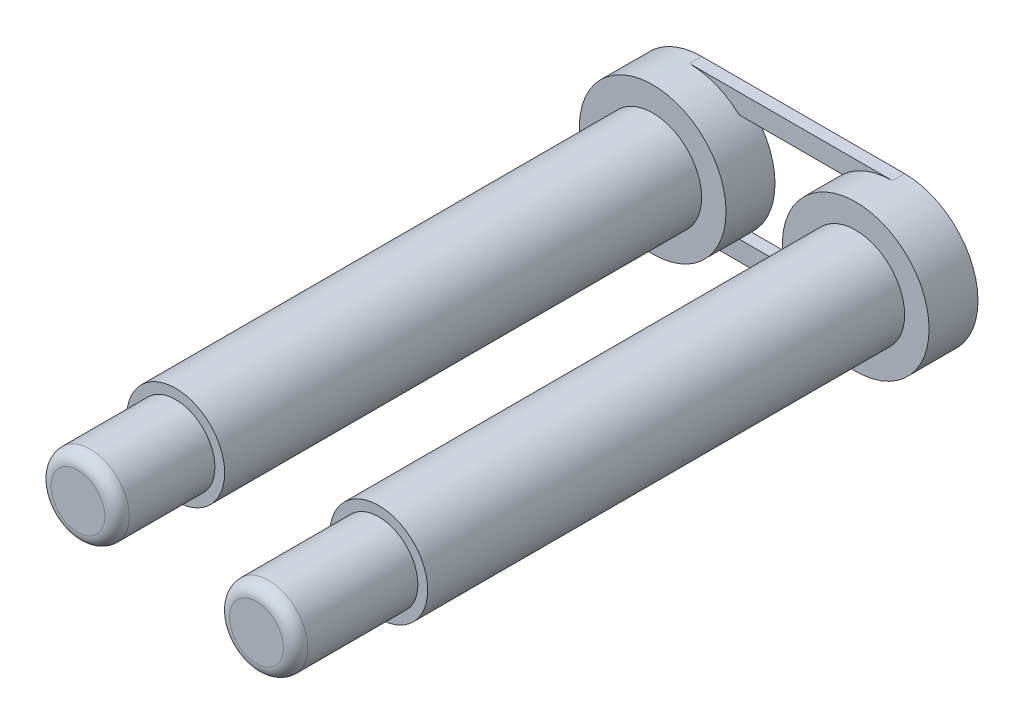
ISO-10303-21;
HEADER;
FILE_DESCRIPTION(('STEP AP214'),'2;1');
FILE_NAME('part.step','',(''),(''),'','','');
FILE_SCHEMA(('AUTOMOTIVE_DESIGN { 1 0 10303 214 1 1 1 1 }'));
ENDSEC;
DATA;
#1=APPLICATION_CONTEXT('core data for automotive mechanical design processes');
#2=APPLICATION_PROTOCOL_DEFINITION('international standard','automotive_design',2000,#1);
#3=PRODUCT_CONTEXT('',#1,'mechanical');
#4=PRODUCT('Part','Part','',(#3));
#5=PRODUCT_RELATED_PRODUCT_CATEGORY('part','',(#4));
#6=PRODUCT_DEFINITION_FORMATION('','',#4);
#7=PRODUCT_DEFINITION_CONTEXT('part definition',#1,'design');
#8=PRODUCT_DEFINITION('design','',#6,#7);
#9=PRODUCT_DEFINITION_SHAPE('','',#8);
#10=(LENGTH_UNIT() NAMED_UNIT(*) SI_UNIT(.MILLI.,.METRE.));
#11=(NAMED_UNIT(*) PLANE_ANGLE_UNIT() SI_UNIT($,.RADIAN.));
#12=(NAMED_UNIT(*) SI_UNIT($,.STERADIAN.) SOLID_ANGLE_UNIT());
#13=UNCERTAINTY_MEASURE_WITH_UNIT(LENGTH_MEASURE(1.E-05),#10,'distance_accuracy_value','');
#14=(GEOMETRIC_REPRESENTATION_CONTEXT(3) GLOBAL_UNCERTAINTY_ASSIGNED_CONTEXT((#13)) GLOBAL_UNIT_ASSIGNED_CONTEXT((#10,
#11,#12)) REPRESENTATION_CONTEXT('',''));
#15=CARTESIAN_POINT('',(0.,0.,0.));
#16=DIRECTION('',(0.,0.,1.));
#17=DIRECTION('',(1.,0.,0.));
#18=AXIS2_PLACEMENT_3D('',#15,#16,#17);
#19=CARTESIAN_POINT('',(23.5,37.3,2.));
#20=DIRECTION('',(0.,0.,-1.));
#21=DIRECTION('',(-1.,0.,0.));
#22=AXIS2_PLACEMENT_3D('',#19,#20,#21);
#23=CYLINDRICAL_SURFACE('',#22,3.);
#24=CARTESIAN_POINT('',(23.5,37.3,2.));
#25=DIRECTION('',(0.,0.,1.));
#26=DIRECTION('',(1.,0.,0.));
#27=AXIS2_PLACEMENT_3D('',#24,#25,#26);
#28=CIRCLE('',#27,3.);
#29=CARTESIAN_POINT('',(26.5,37.3,2.));
#30=VERTEX_POINT('',#29);
#31=EDGE_CURVE('E172',#30,#30,#28,.T.);
#32=ORIENTED_EDGE('',*,*,#31,.F.);
#33=EDGE_LOOP('',(#32));
#34=FACE_BOUND('',#33,.T.);
#35=DIRECTION('',(0.,0.,-1.));
#36=VECTOR('',#35,1.);
#37=CARTESIAN_POINT('',(21.4603921945629,39.5,0.5));
#38=LINE('',#37,#36);
#39=CARTESIAN_POINT('',(21.4603921945629,39.5,0.5));
#40=VERTEX_POINT('',#39);
#41=CARTESIAN_POINT('',(21.4603921945629,39.5,0.));
#42=VERTEX_POINT('',#41);
#43=EDGE_CURVE('E137',#40,#42,#38,.T.);
#44=ORIENTED_EDGE('',*,*,#43,.T.);
#45=CARTESIAN_POINT('',(23.5,37.3,0.));
#46=DIRECTION('',(0.,0.,1.));
#47=DIRECTION('',(1.,0.,0.));
#48=AXIS2_PLACEMENT_3D('',#45,#46,#47);
#49=CIRCLE('',#48,3.);
#50=CARTESIAN_POINT('',(21.4603921945629,35.1,0.));
#51=VERTEX_POINT('',#50);
#52=EDGE_CURVE('E168',#42,#51,#49,.T.);
#53=ORIENTED_EDGE('',*,*,#52,.T.);
#54=DIRECTION('',(0.,0.,-1.));
#55=VECTOR('',#54,1.);
#56=CARTESIAN_POINT('',(21.4603921945629,35.1,0.5));
#57=LINE('',#56,#55);
#58=CARTESIAN_POINT('',(21.4603921945629,35.1,0.5));
#59=VERTEX_POINT('',#58);
#60=EDGE_CURVE('E160',#59,#51,#57,.T.);
#61=ORIENTED_EDGE('',*,*,#60,.F.);
#62=CARTESIAN_POINT('',(23.5,37.3,0.5));
#63=DIRECTION('',(0.,0.,1.));
#64=DIRECTION('',(1.,0.,0.));
#65=AXIS2_PLACEMENT_3D('',#62,#63,#64);
#66=CIRCLE('',#65,3.);
#67=CARTESIAN_POINT('',(23.5,34.3,0.5));
#68=VERTEX_POINT('',#67);
#69=EDGE_CURVE('E148',#59,#68,#66,.T.);
#70=ORIENTED_EDGE('',*,*,#69,.T.);
#71=DIRECTION('',(0.,0.,-1.));
#72=VECTOR('',#71,1.);
#73=CARTESIAN_POINT('',(23.5,34.3,0.5));
#74=LINE('',#73,#72);
#75=CARTESIAN_POINT('',(23.5,34.3,0.));
#76=VERTEX_POINT('',#75);
#77=EDGE_CURVE('E163',#68,#76,#74,.T.);
#78=ORIENTED_EDGE('',*,*,#77,.T.);
#79=CARTESIAN_POINT('',(23.5,40.3,0.));
#80=VERTEX_POINT('',#79);
#81=EDGE_CURVE('E173',#76,#80,#49,.T.);
#82=ORIENTED_EDGE('',*,*,#81,.T.);
#83=DIRECTION('',(0.,0.,-1.));
#84=VECTOR('',#83,1.);
#85=CARTESIAN_POINT('',(23.5,40.3,0.5));
#86=LINE('',#85,#84);
#87=CARTESIAN_POINT('',(23.5,40.3,0.5));
#88=VERTEX_POINT('',#87);
#89=EDGE_CURVE('E59',#88,#80,#86,.T.);
#90=ORIENTED_EDGE('',*,*,#89,.F.);
#91=CARTESIAN_POINT('',(23.5,37.3,0.5));
#92=DIRECTION('',(0.,0.,1.));
#93=DIRECTION('',(1.,0.,0.));
#94=AXIS2_PLACEMENT_3D('',#91,#92,#93);
#95=CIRCLE('',#94,3.);
#96=EDGE_CURVE('E54',#88,#40,#95,.T.);
#97=ORIENTED_EDGE('',*,*,#96,.T.);
#98=EDGE_LOOP('',(#44,#53,#61,#70,#78,#82,#90,#97));
#99=FACE_BOUND('',#98,.T.);
#100=ADVANCED_FACE('F39',(#34,#99),#23,.T.);
#101=CARTESIAN_POINT('',(23.5,37.3,21.5));
#102=DIRECTION('',(0.,0.,-1.));
#103=DIRECTION('',(-1.,0.,0.));
#104=AXIS2_PLACEMENT_3D('',#101,#102,#103);
#105=CYLINDRICAL_SURFACE('',#104,2.);
#106=CARTESIAN_POINT('',(23.5,37.3,2.));
#107=DIRECTION('',(0.,0.,1.));
#108=DIRECTION('',(1.,0.,0.));
#109=AXIS2_PLACEMENT_3D('',#106,#107,#108);
#110=CIRCLE('',#109,2.);
#111=CARTESIAN_POINT('',(25.5,37.3,2.));
#112=VERTEX_POINT('',#111);
#113=EDGE_CURVE('E169',#112,#112,#110,.T.);
#114=ORIENTED_EDGE('',*,*,#113,.T.);
#115=EDGE_LOOP('',(#114));
#116=FACE_BOUND('',#115,.T.);
#117=CARTESIAN_POINT('',(23.5,37.3,21.5));
#118=DIRECTION('',(0.,0.,1.));
#119=DIRECTION('',(1.,0.,0.));
#120=AXIS2_PLACEMENT_3D('',#117,#118,#119);
#121=CIRCLE('',#120,2.);
#122=CARTESIAN_POINT('',(25.5,37.3,21.5));
#123=VERTEX_POINT('',#122);
#124=EDGE_CURVE('E180',#123,#123,#121,.T.);
#125=ORIENTED_EDGE('',*,*,#124,.F.);
#126=EDGE_LOOP('',(#125));
#127=FACE_BOUND('',#126,.T.);
#128=ADVANCED_FACE('F203',(#116,#127),#105,.T.);
#129=CARTESIAN_POINT('',(0.,0.,21.5));
#130=DIRECTION('',(0.,0.,1.));
#131=DIRECTION('',(1.,0.,0.));
#132=AXIS2_PLACEMENT_3D('',#129,#130,#131);
#133=PLANE('',#132);
#134=CARTESIAN_POINT('',(23.5,37.3,21.5));
#135=DIRECTION('',(0.,0.,1.));
#136=DIRECTION('',(1.,0.,0.));
#137=AXIS2_PLACEMENT_3D('',#134,#135,#136);
#138=CIRCLE('',#137,1.6);
#139=CARTESIAN_POINT('',(25.1,37.3,21.5));
#140=VERTEX_POINT('',#139);
#141=EDGE_CURVE('E176',#140,#140,#138,.T.);
#142=ORIENTED_EDGE('',*,*,#141,.F.);
#143=EDGE_LOOP('',(#142));
#144=FACE_BOUND('',#143,.T.);
#145=ORIENTED_EDGE('',*,*,#124,.T.);
#146=EDGE_LOOP('',(#145));
#147=FACE_BOUND('',#146,.T.);
#148=ADVANCED_FACE('F209',(#144,#147),#133,.T.);
#149=CARTESIAN_POINT('',(23.5,37.3,26.5));
#150=DIRECTION('',(0.,0.,-1.));
#151=DIRECTION('',(-1.,0.,0.));
#152=AXIS2_PLACEMENT_3D('',#149,#150,#151);
#153=CYLINDRICAL_SURFACE('',#152,1.6);
#154=CARTESIAN_POINT('',(23.5,37.3,26.));
#155=DIRECTION('',(0.,0.,1.));
#156=DIRECTION('',(1.,0.,0.));
#157=AXIS2_PLACEMENT_3D('',#154,#155,#156);
#158=CIRCLE('',#157,1.6);
#159=CARTESIAN_POINT('',(25.1,37.3,26.));
#160=VERTEX_POINT('',#159);
#161=EDGE_CURVE('E186',#160,#160,#158,.F.);
#162=ORIENTED_EDGE('',*,*,#161,.T.);
#163=EDGE_LOOP('',(#162));
#164=FACE_BOUND('',#163,.T.);
#165=ORIENTED_EDGE('',*,*,#141,.T.);
#166=EDGE_LOOP('',(#165));
#167=FACE_BOUND('',#166,.T.);
#168=ADVANCED_FACE('F220',(#164,#167),#153,.T.);
#169=CARTESIAN_POINT('',(0.,0.,26.5));
#170=DIRECTION('',(0.,0.,1.));
#171=DIRECTION('',(1.,0.,0.));
#172=AXIS2_PLACEMENT_3D('',#169,#170,#171);
#173=PLANE('',#172);
#174=CARTESIAN_POINT('',(23.5,37.3,26.5));
#175=DIRECTION('',(0.,0.,1.));
#176=DIRECTION('',(1.,0.,0.));
#177=AXIS2_PLACEMENT_3D('',#174,#175,#176);
#178=CIRCLE('',#177,1.1);
#179=CARTESIAN_POINT('',(24.6,37.3,26.5));
#180=VERTEX_POINT('',#179);
#181=EDGE_CURVE('E183',#180,#180,#178,.T.);
#182=ORIENTED_EDGE('',*,*,#181,.T.);
#183=EDGE_LOOP('',(#182));
#184=FACE_BOUND('',#183,.T.);
#185=ADVANCED_FACE('F217',(#184),#173,.T.);
#186=CARTESIAN_POINT('',(0.,0.,2.));
#187=DIRECTION('',(0.,0.,1.));
#188=DIRECTION('',(1.,0.,0.));
#189=AXIS2_PLACEMENT_3D('',#186,#187,#188);
#190=PLANE('',#189);
#191=ORIENTED_EDGE('',*,*,#113,.F.);
#192=EDGE_LOOP('',(#191));
#193=FACE_BOUND('',#192,.T.);
#194=ORIENTED_EDGE('',*,*,#31,.T.);
#195=EDGE_LOOP('',(#194));
#196=FACE_BOUND('',#195,.T.);
#197=ADVANCED_FACE('F215',(#193,#196),#190,.T.);
#198=CARTESIAN_POINT('',(0.,0.,0.));
#199=DIRECTION('',(0.,0.,1.));
#200=DIRECTION('',(1.,0.,0.));
#201=AXIS2_PLACEMENT_3D('',#198,#199,#200);
#202=PLANE('',#201);
#203=CARTESIAN_POINT('',(15.2,37.3,0.));
#204=DIRECTION('',(0.,0.,1.));
#205=DIRECTION('',(1.,0.,0.));
#206=AXIS2_PLACEMENT_3D('',#203,#204,#205);
#207=CIRCLE('',#206,3.);
#208=CARTESIAN_POINT('',(17.2396078054371,35.1,0.));
#209=VERTEX_POINT('',#208);
#210=CARTESIAN_POINT('',(17.2396078054371,39.5,0.));
#211=VERTEX_POINT('',#210);
#212=EDGE_CURVE('E129',#209,#211,#207,.T.);
#213=ORIENTED_EDGE('',*,*,#212,.F.);
#214=DIRECTION('',(1.,0.,0.));
#215=VECTOR('',#214,1.);
#216=CARTESIAN_POINT('',(0.,35.1,0.));
#217=LINE('',#216,#215);
#218=EDGE_CURVE('E145',#209,#51,#217,.T.);
#219=ORIENTED_EDGE('',*,*,#218,.T.);
#220=ORIENTED_EDGE('',*,*,#52,.F.);
#221=DIRECTION('',(1.,0.,0.));
#222=VECTOR('',#221,1.);
#223=CARTESIAN_POINT('',(0.,39.5,0.));
#224=LINE('',#223,#222);
#225=EDGE_CURVE('E126',#211,#42,#224,.T.);
#226=ORIENTED_EDGE('',*,*,#225,.F.);
#227=EDGE_LOOP('',(#213,#219,#220,#226));
#228=FACE_BOUND('',#227,.T.);
#229=ORIENTED_EDGE('',*,*,#81,.F.);
#230=DIRECTION('',(1.,0.,0.));
#231=VECTOR('',#230,1.);
#232=CARTESIAN_POINT('',(0.,34.3,0.));
#233=LINE('',#232,#231);
#234=CARTESIAN_POINT('',(15.2,34.3,0.));
#235=VERTEX_POINT('',#234);
#236=EDGE_CURVE('E140',#235,#76,#233,.T.);
#237=ORIENTED_EDGE('',*,*,#236,.F.);
#238=CARTESIAN_POINT('',(15.2,40.3,0.));
#239=VERTEX_POINT('',#238);
#240=EDGE_CURVE('E276',#239,#235,#207,.T.);
#241=ORIENTED_EDGE('',*,*,#240,.F.);
#242=DIRECTION('',(1.,0.,0.));
#243=VECTOR('',#242,1.);
#244=CARTESIAN_POINT('',(0.,40.3,0.));
#245=LINE('',#244,#243);
#246=EDGE_CURVE('E115',#239,#80,#245,.T.);
#247=ORIENTED_EDGE('',*,*,#246,.T.);
#248=EDGE_LOOP('',(#229,#237,#241,#247));
#249=FACE_BOUND('',#248,.T.);
#250=ADVANCED_FACE('F228',(#228,#249),#202,.F.);
#251=CARTESIAN_POINT('',(0.,34.3,0.5));
#252=DIRECTION('',(0.,1.,0.));
#253=DIRECTION('',(0.,0.,1.));
#254=AXIS2_PLACEMENT_3D('',#251,#252,#253);
#255=PLANE('',#254);
#256=ORIENTED_EDGE('',*,*,#236,.T.);
#257=ORIENTED_EDGE('',*,*,#77,.F.);
#258=DIRECTION('',(1.,0.,0.));
#259=VECTOR('',#258,1.);
#260=CARTESIAN_POINT('',(0.,34.3,0.5));
#261=LINE('',#260,#259);
#262=CARTESIAN_POINT('',(15.2,34.3,0.5));
#263=VERTEX_POINT('',#262);
#264=EDGE_CURVE('E144',#263,#68,#261,.T.);
#265=ORIENTED_EDGE('',*,*,#264,.F.);
#266=DIRECTION('',(0.,0.,-1.));
#267=VECTOR('',#266,1.);
#268=CARTESIAN_POINT('',(15.2,34.3,0.5));
#269=LINE('',#268,#267);
#270=EDGE_CURVE('E166',#263,#235,#269,.T.);
#271=ORIENTED_EDGE('',*,*,#270,.T.);
#272=EDGE_LOOP('',(#256,#257,#265,#271));
#273=FACE_BOUND('',#272,.T.);
#274=ADVANCED_FACE('F230',(#273),#255,.F.);
#275=CARTESIAN_POINT('',(0.,35.1,0.5));
#276=DIRECTION('',(0.,1.,0.));
#277=DIRECTION('',(0.,0.,1.));
#278=AXIS2_PLACEMENT_3D('',#275,#276,#277);
#279=PLANE('',#278);
#280=ORIENTED_EDGE('',*,*,#218,.F.);
#281=DIRECTION('',(0.,0.,-1.));
#282=VECTOR('',#281,1.);
#283=CARTESIAN_POINT('',(17.2396078054371,35.1,0.5));
#284=LINE('',#283,#282);
#285=CARTESIAN_POINT('',(17.2396078054371,35.1,0.5));
#286=VERTEX_POINT('',#285);
#287=EDGE_CURVE('E153',#286,#209,#284,.T.);
#288=ORIENTED_EDGE('',*,*,#287,.F.);
#289=DIRECTION('',(1.,0.,0.));
#290=VECTOR('',#289,1.);
#291=CARTESIAN_POINT('',(0.,35.1,0.5));
#292=LINE('',#291,#290);
#293=EDGE_CURVE('E150',#286,#59,#292,.T.);
#294=ORIENTED_EDGE('',*,*,#293,.T.);
#295=ORIENTED_EDGE('',*,*,#60,.T.);
#296=EDGE_LOOP('',(#280,#288,#294,#295));
#297=FACE_BOUND('',#296,.T.);
#298=ADVANCED_FACE('F264',(#297),#279,.T.);
#299=CARTESIAN_POINT('',(0.,0.,0.5));
#300=DIRECTION('',(0.,0.,1.));
#301=DIRECTION('',(1.,0.,0.));
#302=AXIS2_PLACEMENT_3D('',#299,#300,#301);
#303=PLANE('',#302);
#304=CARTESIAN_POINT('',(15.2,37.3,0.5));
#305=DIRECTION('',(0.,0.,1.));
#306=DIRECTION('',(1.,0.,0.));
#307=AXIS2_PLACEMENT_3D('',#304,#305,#306);
#308=CIRCLE('',#307,3.);
#309=EDGE_CURVE('E141',#263,#286,#308,.T.);
#310=ORIENTED_EDGE('',*,*,#309,.F.);
#311=ORIENTED_EDGE('',*,*,#264,.T.);
#312=ORIENTED_EDGE('',*,*,#69,.F.);
#313=ORIENTED_EDGE('',*,*,#293,.F.);
#314=EDGE_LOOP('',(#310,#311,#312,#313));
#315=FACE_BOUND('',#314,.T.);
#316=ADVANCED_FACE('F260',(#315),#303,.T.);
#317=CARTESIAN_POINT('',(0.,39.5,0.5));
#318=DIRECTION('',(0.,1.,0.));
#319=DIRECTION('',(0.,0.,1.));
#320=AXIS2_PLACEMENT_3D('',#317,#318,#319);
#321=PLANE('',#320);
#322=ORIENTED_EDGE('',*,*,#225,.T.);
#323=ORIENTED_EDGE('',*,*,#43,.F.);
#324=DIRECTION('',(1.,0.,0.));
#325=VECTOR('',#324,1.);
#326=CARTESIAN_POINT('',(0.,39.5,0.5));
#327=LINE('',#326,#325);
#328=CARTESIAN_POINT('',(17.2396078054371,39.5,0.5));
#329=VERTEX_POINT('',#328);
#330=EDGE_CURVE('E123',#329,#40,#327,.T.);
#331=ORIENTED_EDGE('',*,*,#330,.F.);
#332=DIRECTION('',(0.,0.,-1.));
#333=VECTOR('',#332,1.);
#334=CARTESIAN_POINT('',(17.2396078054371,39.5,0.5));
#335=LINE('',#334,#333);
#336=EDGE_CURVE('E122',#329,#211,#335,.T.);
#337=ORIENTED_EDGE('',*,*,#336,.T.);
#338=EDGE_LOOP('',(#322,#323,#331,#337));
#339=FACE_BOUND('',#338,.T.);
#340=ADVANCED_FACE('F254',(#339),#321,.F.);
#341=CARTESIAN_POINT('',(0.,40.3,0.5));
#342=DIRECTION('',(0.,1.,0.));
#343=DIRECTION('',(0.,0.,1.));
#344=AXIS2_PLACEMENT_3D('',#341,#342,#343);
#345=PLANE('',#344);
#346=ORIENTED_EDGE('',*,*,#246,.F.);
#347=DIRECTION('',(0.,0.,-1.));
#348=VECTOR('',#347,1.);
#349=CARTESIAN_POINT('',(15.2,40.3,0.5));
#350=LINE('',#349,#348);
#351=CARTESIAN_POINT('',(15.2,40.3,0.5));
#352=VERTEX_POINT('',#351);
#353=EDGE_CURVE('E110',#352,#239,#350,.T.);
#354=ORIENTED_EDGE('',*,*,#353,.F.);
#355=DIRECTION('',(1.,0.,0.));
#356=VECTOR('',#355,1.);
#357=CARTESIAN_POINT('',(0.,40.3,0.5));
#358=LINE('',#357,#356);
#359=EDGE_CURVE('E103',#352,#88,#358,.T.);
#360=ORIENTED_EDGE('',*,*,#359,.T.);
#361=ORIENTED_EDGE('',*,*,#89,.T.);
#362=EDGE_LOOP('',(#346,#354,#360,#361));
#363=FACE_BOUND('',#362,.T.);
#364=ADVANCED_FACE('F113',(#363),#345,.T.);
#365=CARTESIAN_POINT('',(0.,0.,0.5));
#366=DIRECTION('',(0.,0.,1.));
#367=DIRECTION('',(1.,0.,0.));
#368=AXIS2_PLACEMENT_3D('',#365,#366,#367);
#369=PLANE('',#368);
#370=CARTESIAN_POINT('',(15.2,37.3,0.5));
#371=DIRECTION('',(0.,0.,1.));
#372=DIRECTION('',(1.,0.,0.));
#373=AXIS2_PLACEMENT_3D('',#370,#371,#372);
#374=CIRCLE('',#373,3.);
#375=EDGE_CURVE('E107',#329,#352,#374,.T.);
#376=ORIENTED_EDGE('',*,*,#375,.F.);
#377=ORIENTED_EDGE('',*,*,#330,.T.);
#378=ORIENTED_EDGE('',*,*,#96,.F.);
#379=ORIENTED_EDGE('',*,*,#359,.F.);
#380=EDGE_LOOP('',(#376,#377,#378,#379));
#381=FACE_BOUND('',#380,.T.);
#382=ADVANCED_FACE('F105',(#381),#369,.T.);
#383=CARTESIAN_POINT('',(23.5,37.3,26.));
#384=DIRECTION('',(0.,0.,1.));
#385=DIRECTION('',(1.,0.,0.));
#386=AXIS2_PLACEMENT_3D('',#383,#384,#385);
#387=TOROIDAL_SURFACE('',#386,1.1,0.5);
#388=ORIENTED_EDGE('',*,*,#161,.F.);
#389=EDGE_LOOP('',(#388));
#390=FACE_BOUND('',#389,.T.);
#391=ORIENTED_EDGE('',*,*,#181,.F.);
#392=EDGE_LOOP('',(#391));
#393=FACE_BOUND('',#392,.T.);
#394=ADVANCED_FACE('F232',(#390,#393),#387,.T.);
#395=CARTESIAN_POINT('',(15.2,37.3,2.));
#396=DIRECTION('',(0.,0.,-1.));
#397=DIRECTION('',(-1.,0.,0.));
#398=AXIS2_PLACEMENT_3D('',#395,#396,#397);
#399=CYLINDRICAL_SURFACE('',#398,3.);
#400=CARTESIAN_POINT('',(15.2,37.3,2.));
#401=DIRECTION('',(0.,0.,1.));
#402=DIRECTION('',(1.,0.,0.));
#403=AXIS2_PLACEMENT_3D('',#400,#401,#402);
#404=CIRCLE('',#403,3.);
#405=CARTESIAN_POINT('',(18.2,37.3,2.));
#406=VERTEX_POINT('',#405);
#407=EDGE_CURVE('E134',#406,#406,#404,.T.);
#408=ORIENTED_EDGE('',*,*,#407,.F.);
#409=EDGE_LOOP('',(#408));
#410=FACE_BOUND('',#409,.T.);
#411=ORIENTED_EDGE('',*,*,#240,.T.);
#412=ORIENTED_EDGE('',*,*,#270,.F.);
#413=ORIENTED_EDGE('',*,*,#309,.T.);
#414=ORIENTED_EDGE('',*,*,#287,.T.);
#415=ORIENTED_EDGE('',*,*,#212,.T.);
#416=ORIENTED_EDGE('',*,*,#336,.F.);
#417=ORIENTED_EDGE('',*,*,#375,.T.);
#418=ORIENTED_EDGE('',*,*,#353,.T.);
#419=EDGE_LOOP('',(#411,#412,#413,#414,#415,#416,#417,#418));
#420=FACE_BOUND('',#419,.T.);
#421=ADVANCED_FACE('F120',(#410,#420),#399,.T.);
#422=CARTESIAN_POINT('',(0.,0.,2.));
#423=DIRECTION('',(0.,0.,1.));
#424=DIRECTION('',(1.,0.,0.));
#425=AXIS2_PLACEMENT_3D('',#422,#423,#424);
#426=PLANE('',#425);
#427=CARTESIAN_POINT('',(15.2,37.3,2.));
#428=DIRECTION('',(0.,0.,1.));
#429=DIRECTION('',(1.,0.,0.));
#430=AXIS2_PLACEMENT_3D('',#427,#428,#429);
#431=CIRCLE('',#430,2.);
#432=CARTESIAN_POINT('',(17.2,37.3,2.));
#433=VERTEX_POINT('',#432);
#434=EDGE_CURVE('E277',#433,#433,#431,.T.);
#435=ORIENTED_EDGE('',*,*,#434,.F.);
#436=EDGE_LOOP('',(#435));
#437=FACE_BOUND('',#436,.T.);
#438=ORIENTED_EDGE('',*,*,#407,.T.);
#439=EDGE_LOOP('',(#438));
#440=FACE_BOUND('',#439,.T.);
#441=ADVANCED_FACE('F239',(#437,#440),#426,.T.);
#442=CARTESIAN_POINT('',(15.2,37.3,21.5));
#443=DIRECTION('',(0.,0.,-1.));
#444=DIRECTION('',(-1.,0.,0.));
#445=AXIS2_PLACEMENT_3D('',#442,#443,#444);
#446=CYLINDRICAL_SURFACE('',#445,2.);
#447=ORIENTED_EDGE('',*,*,#434,.T.);
#448=EDGE_LOOP('',(#447));
#449=FACE_BOUND('',#448,.T.);
#450=CARTESIAN_POINT('',(15.2,37.3,21.5));
#451=DIRECTION('',(0.,0.,1.));
#452=DIRECTION('',(1.,0.,0.));
#453=AXIS2_PLACEMENT_3D('',#450,#451,#452);
#454=CIRCLE('',#453,2.);
#455=CARTESIAN_POINT('',(17.2,37.3,21.5));
#456=VERTEX_POINT('',#455);
#457=EDGE_CURVE('E280',#456,#456,#454,.T.);
#458=ORIENTED_EDGE('',*,*,#457,.F.);
#459=EDGE_LOOP('',(#458));
#460=FACE_BOUND('',#459,.T.);
#461=ADVANCED_FACE('F293',(#449,#460),#446,.T.);
#462=CARTESIAN_POINT('',(0.,0.,21.5));
#463=DIRECTION('',(0.,0.,1.));
#464=DIRECTION('',(1.,0.,0.));
#465=AXIS2_PLACEMENT_3D('',#462,#463,#464);
#466=PLANE('',#465);
#467=CARTESIAN_POINT('',(15.2,37.3,21.5));
#468=DIRECTION('',(0.,0.,1.));
#469=DIRECTION('',(1.,0.,0.));
#470=AXIS2_PLACEMENT_3D('',#467,#468,#469);
#471=CIRCLE('',#470,1.6);
#472=CARTESIAN_POINT('',(16.8,37.3,21.5));
#473=VERTEX_POINT('',#472);
#474=EDGE_CURVE('E283',#473,#473,#471,.T.);
#475=ORIENTED_EDGE('',*,*,#474,.F.);
#476=EDGE_LOOP('',(#475));
#477=FACE_BOUND('',#476,.T.);
#478=ORIENTED_EDGE('',*,*,#457,.T.);
#479=EDGE_LOOP('',(#478));
#480=FACE_BOUND('',#479,.T.);
#481=ADVANCED_FACE('F298',(#477,#480),#466,.T.);
#482=CARTESIAN_POINT('',(0.,0.,25.5));
#483=DIRECTION('',(0.,0.,1.));
#484=DIRECTION('',(1.,0.,0.));
#485=AXIS2_PLACEMENT_3D('',#482,#483,#484);
#486=PLANE('',#485);
#487=CARTESIAN_POINT('',(15.2,37.3,25.5));
#488=DIRECTION('',(0.,0.,1.));
#489=DIRECTION('',(1.,0.,0.));
#490=AXIS2_PLACEMENT_3D('',#487,#488,#489);
#491=CIRCLE('',#490,1.1);
#492=CARTESIAN_POINT('',(16.3,37.3,25.5));
#493=VERTEX_POINT('',#492);
#494=EDGE_CURVE('E47',#493,#493,#491,.T.);
#495=ORIENTED_EDGE('',*,*,#494,.T.);
#496=EDGE_LOOP('',(#495));
#497=FACE_BOUND('',#496,.T.);
#498=ADVANCED_FACE('F191',(#497),#486,.T.);
#499=CARTESIAN_POINT('',(15.2,37.3,25.5));
#500=DIRECTION('',(0.,0.,-1.));
#501=DIRECTION('',(-1.,0.,0.));
#502=AXIS2_PLACEMENT_3D('',#499,#500,#501);
#503=CYLINDRICAL_SURFACE('',#502,1.6);
#504=CARTESIAN_POINT('',(15.2,37.3,25.));
#505=DIRECTION('',(0.,0.,1.));
#506=DIRECTION('',(1.,0.,0.));
#507=AXIS2_PLACEMENT_3D('',#504,#505,#506);
#508=CIRCLE('',#507,1.6);
#509=CARTESIAN_POINT('',(16.8,37.3,25.));
#510=VERTEX_POINT('',#509);
#511=EDGE_CURVE('E11',#510,#510,#508,.F.);
#512=ORIENTED_EDGE('',*,*,#511,.T.);
#513=EDGE_LOOP('',(#512));
#514=FACE_BOUND('',#513,.T.);
#515=ORIENTED_EDGE('',*,*,#474,.T.);
#516=EDGE_LOOP('',(#515));
#517=FACE_BOUND('',#516,.T.);
#518=ADVANCED_FACE('F194',(#514,#517),#503,.T.);
#519=CARTESIAN_POINT('',(15.2,37.3,25.));
#520=DIRECTION('',(0.,0.,1.));
#521=DIRECTION('',(1.,0.,0.));
#522=AXIS2_PLACEMENT_3D('',#519,#520,#521);
#523=TOROIDAL_SURFACE('',#522,1.1,0.5);
#524=ORIENTED_EDGE('',*,*,#511,.F.);
#525=EDGE_LOOP('',(#524));
#526=FACE_BOUND('',#525,.T.);
#527=ORIENTED_EDGE('',*,*,#494,.F.);
#528=EDGE_LOOP('',(#527));
#529=FACE_BOUND('',#528,.T.);
#530=ADVANCED_FACE('F41',(#526,#529),#523,.T.);
#531=CLOSED_SHELL('',(#100,#128,#148,#168,#185,#197,#250,#274,#298,#316,#340,#364,#382,#394,
#421,#441,#461,#481,#498,#518,#530));
#532=MANIFOLD_SOLID_BREP('B2',#531);
#533=ADVANCED_BREP_SHAPE_REPRESENTATION('',(#18,#532),#14);
#534=SHAPE_DEFINITION_REPRESENTATION(#9,#533);
ENDSEC;
END-ISO-10303-21;
